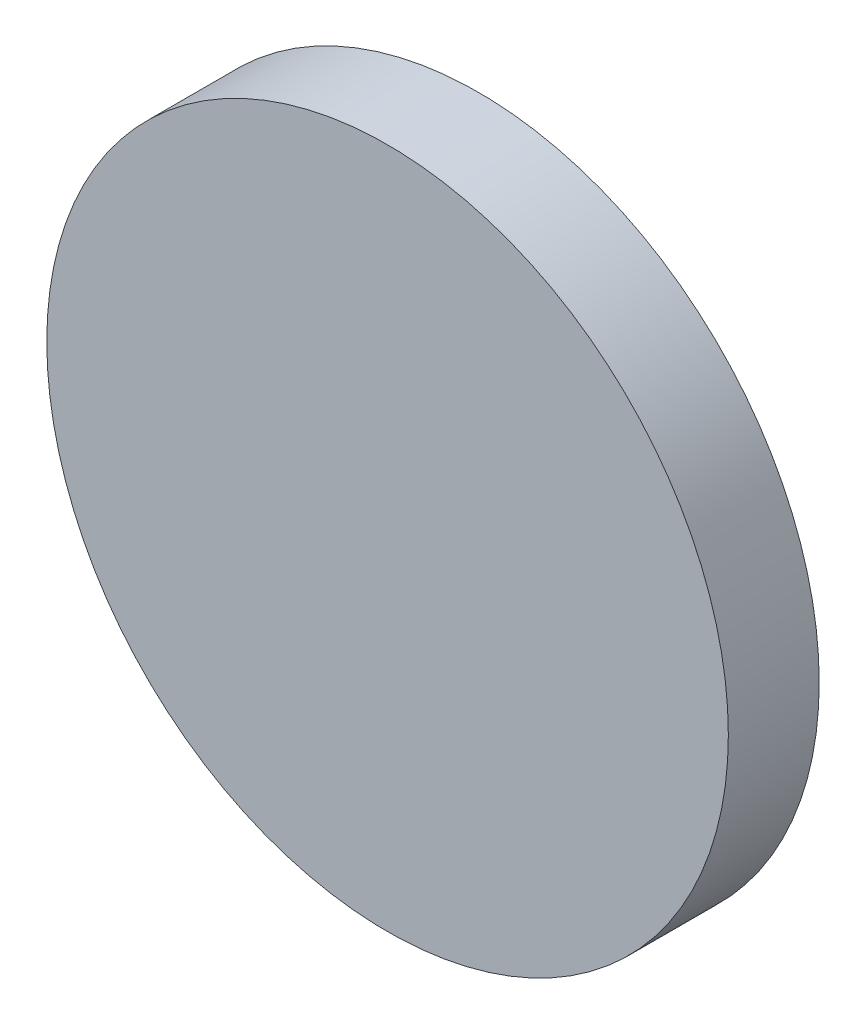
ISO-10303-21;
HEADER;
FILE_DESCRIPTION(('STEP AP214'),'2;1');
FILE_NAME('part.step','',(''),(''),'','','');
FILE_SCHEMA(('AUTOMOTIVE_DESIGN { 1 0 10303 214 1 1 1 1 }'));
ENDSEC;
DATA;
#1=APPLICATION_CONTEXT('core data for automotive mechanical design processes');
#2=APPLICATION_PROTOCOL_DEFINITION('international standard','automotive_design',2000,#1);
#3=PRODUCT_CONTEXT('',#1,'mechanical');
#4=PRODUCT('Part','Part','',(#3));
#5=PRODUCT_RELATED_PRODUCT_CATEGORY('part','',(#4));
#6=PRODUCT_DEFINITION_FORMATION('','',#4);
#7=PRODUCT_DEFINITION_CONTEXT('part definition',#1,'design');
#8=PRODUCT_DEFINITION('design','',#6,#7);
#9=PRODUCT_DEFINITION_SHAPE('','',#8);
#10=(LENGTH_UNIT() NAMED_UNIT(*) SI_UNIT(.MILLI.,.METRE.));
#11=(NAMED_UNIT(*) PLANE_ANGLE_UNIT() SI_UNIT($,.RADIAN.));
#12=(NAMED_UNIT(*) SI_UNIT($,.STERADIAN.) SOLID_ANGLE_UNIT());
#13=UNCERTAINTY_MEASURE_WITH_UNIT(LENGTH_MEASURE(1.E-05),#10,'distance_accuracy_value','');
#14=(GEOMETRIC_REPRESENTATION_CONTEXT(3) GLOBAL_UNCERTAINTY_ASSIGNED_CONTEXT((#13)) GLOBAL_UNIT_ASSIGNED_CONTEXT((#10,
#11,#12)) REPRESENTATION_CONTEXT('',''));
#15=CARTESIAN_POINT('',(0.,0.,0.));
#16=DIRECTION('',(0.,0.,1.));
#17=DIRECTION('',(1.,0.,0.));
#18=AXIS2_PLACEMENT_3D('',#15,#16,#17);
#19=CARTESIAN_POINT('',(0.,0.,2.));
#20=DIRECTION('',(0.,0.,-1.));
#21=DIRECTION('',(-1.,0.,0.));
#22=AXIS2_PLACEMENT_3D('',#19,#20,#21);
#23=CYLINDRICAL_SURFACE('',#22,7.5);
#24=CARTESIAN_POINT('',(0.,0.,2.));
#25=DIRECTION('',(0.,0.,1.));
#26=DIRECTION('',(1.,0.,0.));
#27=AXIS2_PLACEMENT_3D('',#24,#25,#26);
#28=CIRCLE('',#27,7.5);
#29=CARTESIAN_POINT('',(7.5,0.,2.));
#30=VERTEX_POINT('',#29);
#31=EDGE_CURVE('E10',#30,#30,#28,.T.);
#32=ORIENTED_EDGE('',*,*,#31,.F.);
#33=EDGE_LOOP('',(#32));
#34=FACE_BOUND('',#33,.T.);
#35=CARTESIAN_POINT('',(0.,0.,0.));
#36=DIRECTION('',(0.,0.,1.));
#37=DIRECTION('',(1.,0.,0.));
#38=AXIS2_PLACEMENT_3D('',#35,#36,#37);
#39=CIRCLE('',#38,7.5);
#40=CARTESIAN_POINT('',(7.5,0.,0.));
#41=VERTEX_POINT('',#40);
#42=EDGE_CURVE('E40',#41,#41,#39,.T.);
#43=ORIENTED_EDGE('',*,*,#42,.T.);
#44=EDGE_LOOP('',(#43));
#45=FACE_BOUND('',#44,.T.);
#46=ADVANCED_FACE('F37',(#34,#45),#23,.T.);
#47=CARTESIAN_POINT('',(0.,0.,2.));
#48=DIRECTION('',(0.,0.,1.));
#49=DIRECTION('',(1.,0.,0.));
#50=AXIS2_PLACEMENT_3D('',#47,#48,#49);
#51=PLANE('',#50);
#52=ORIENTED_EDGE('',*,*,#31,.T.);
#53=EDGE_LOOP('',(#52));
#54=FACE_BOUND('',#53,.T.);
#55=ADVANCED_FACE('F66',(#54),#51,.T.);
#56=CARTESIAN_POINT('',(0.,0.,0.));
#57=DIRECTION('',(0.,0.,1.));
#58=DIRECTION('',(1.,0.,0.));
#59=AXIS2_PLACEMENT_3D('',#56,#57,#58);
#60=PLANE('',#59);
#61=CARTESIAN_POINT('',(0.,0.,0.));
#62=DIRECTION('',(0.,0.,-1.));
#63=DIRECTION('',(-1.,0.,0.));
#64=AXIS2_PLACEMENT_3D('',#61,#62,#63);
#65=CIRCLE('',#64,5.015);
#66=CARTESIAN_POINT('',(-5.015,0.,0.));
#67=VERTEX_POINT('',#66);
#68=EDGE_CURVE('E49',#67,#67,#65,.T.);
#69=ORIENTED_EDGE('',*,*,#68,.F.);
#70=EDGE_LOOP('',(#69));
#71=FACE_BOUND('',#70,.T.);
#72=ORIENTED_EDGE('',*,*,#42,.F.);
#73=EDGE_LOOP('',(#72));
#74=FACE_BOUND('',#73,.T.);
#75=ADVANCED_FACE('F60',(#71,#74),#60,.F.);
#76=CARTESIAN_POINT('',(0.,0.,0.5));
#77=DIRECTION('',(0.,0.,-1.));
#78=DIRECTION('',(-1.,0.,0.));
#79=AXIS2_PLACEMENT_3D('',#76,#77,#78);
#80=CYLINDRICAL_SURFACE('',#79,5.015);
#81=CARTESIAN_POINT('',(0.,0.,0.5));
#82=DIRECTION('',(0.,0.,-1.));
#83=DIRECTION('',(-1.,0.,0.));
#84=AXIS2_PLACEMENT_3D('',#81,#82,#83);
#85=CIRCLE('',#84,5.015);
#86=CARTESIAN_POINT('',(-5.015,0.,0.5));
#87=VERTEX_POINT('',#86);
#88=EDGE_CURVE('E47',#87,#87,#85,.T.);
#89=ORIENTED_EDGE('',*,*,#88,.F.);
#90=EDGE_LOOP('',(#89));
#91=FACE_BOUND('',#90,.T.);
#92=ORIENTED_EDGE('',*,*,#68,.T.);
#93=EDGE_LOOP('',(#92));
#94=FACE_BOUND('',#93,.T.);
#95=ADVANCED_FACE('F57',(#91,#94),#80,.F.);
#96=CARTESIAN_POINT('',(0.,0.,0.5));
#97=DIRECTION('',(0.,0.,-1.));
#98=DIRECTION('',(-1.,0.,0.));
#99=AXIS2_PLACEMENT_3D('',#96,#97,#98);
#100=PLANE('',#99);
#101=ORIENTED_EDGE('',*,*,#88,.T.);
#102=EDGE_LOOP('',(#101));
#103=FACE_BOUND('',#102,.T.);
#104=ADVANCED_FACE('F55',(#103),#100,.T.);
#105=CLOSED_SHELL('',(#46,#55,#75,#95,#104));
#106=MANIFOLD_SOLID_BREP('B2',#105);
#107=ADVANCED_BREP_SHAPE_REPRESENTATION('',(#18,#106),#14);
#108=SHAPE_DEFINITION_REPRESENTATION(#9,#107);
ENDSEC;
END-ISO-10303-21;
